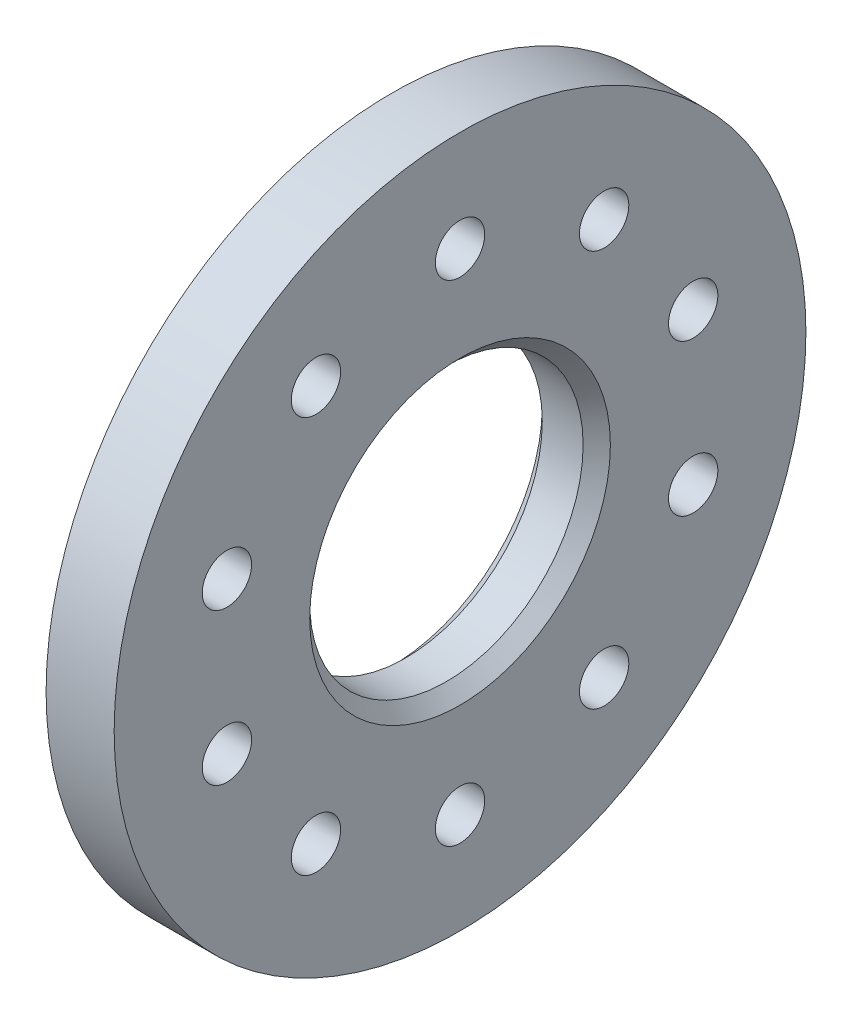
ISO-10303-21;
HEADER;
FILE_DESCRIPTION(('STEP AP214'),'2;1');
FILE_NAME('part.step','',(''),(''),'','','');
FILE_SCHEMA(('AUTOMOTIVE_DESIGN { 1 0 10303 214 1 1 1 1 }'));
ENDSEC;
DATA;
#1=APPLICATION_CONTEXT('core data for automotive mechanical design processes');
#2=APPLICATION_PROTOCOL_DEFINITION('international standard','automotive_design',2000,#1);
#3=PRODUCT_CONTEXT('',#1,'mechanical');
#4=PRODUCT('Part','Part','',(#3));
#5=PRODUCT_RELATED_PRODUCT_CATEGORY('part','',(#4));
#6=PRODUCT_DEFINITION_FORMATION('','',#4);
#7=PRODUCT_DEFINITION_CONTEXT('part definition',#1,'design');
#8=PRODUCT_DEFINITION('design','',#6,#7);
#9=PRODUCT_DEFINITION_SHAPE('','',#8);
#10=(LENGTH_UNIT() NAMED_UNIT(*) SI_UNIT(.MILLI.,.METRE.));
#11=(NAMED_UNIT(*) PLANE_ANGLE_UNIT() SI_UNIT($,.RADIAN.));
#12=(NAMED_UNIT(*) SI_UNIT($,.STERADIAN.) SOLID_ANGLE_UNIT());
#13=UNCERTAINTY_MEASURE_WITH_UNIT(LENGTH_MEASURE(1.E-05),#10,'distance_accuracy_value','');
#14=(GEOMETRIC_REPRESENTATION_CONTEXT(3) GLOBAL_UNCERTAINTY_ASSIGNED_CONTEXT((#13)) GLOBAL_UNIT_ASSIGNED_CONTEXT((#10,
#11,#12)) REPRESENTATION_CONTEXT('',''));
#15=CARTESIAN_POINT('',(0.,0.,0.));
#16=DIRECTION('',(0.,0.,1.));
#17=DIRECTION('',(1.,0.,0.));
#18=AXIS2_PLACEMENT_3D('',#15,#16,#17);
#19=CARTESIAN_POINT('',(7.9375,0.,0.));
#20=DIRECTION('',(-1.,0.,0.));
#21=DIRECTION('',(0.,0.,1.));
#22=AXIS2_PLACEMENT_3D('',#19,#20,#21);
#23=CYLINDRICAL_SURFACE('',#22,80.645);
#24=CARTESIAN_POINT('',(7.9375,0.,0.));
#25=DIRECTION('',(1.,0.,0.));
#26=DIRECTION('',(0.,0.,-1.));
#27=AXIS2_PLACEMENT_3D('',#24,#25,#26);
#28=CIRCLE('',#27,80.645);
#29=CARTESIAN_POINT('',(7.9375,0.,-80.645));
#30=VERTEX_POINT('',#29);
#31=EDGE_CURVE('E59',#30,#30,#28,.T.);
#32=ORIENTED_EDGE('',*,*,#31,.F.);
#33=EDGE_LOOP('',(#32));
#34=FACE_BOUND('',#33,.T.);
#35=CARTESIAN_POINT('',(-7.9375,0.,0.));
#36=DIRECTION('',(1.,0.,0.));
#37=DIRECTION('',(0.,0.,-1.));
#38=AXIS2_PLACEMENT_3D('',#35,#36,#37);
#39=CIRCLE('',#38,80.645);
#40=CARTESIAN_POINT('',(-7.9375,0.,-80.645));
#41=VERTEX_POINT('',#40);
#42=EDGE_CURVE('E60',#41,#41,#39,.T.);
#43=ORIENTED_EDGE('',*,*,#42,.T.);
#44=EDGE_LOOP('',(#43));
#45=FACE_BOUND('',#44,.T.);
#46=ADVANCED_FACE('F35',(#34,#45),#23,.T.);
#47=CARTESIAN_POINT('',(7.9375,0.,0.));
#48=DIRECTION('',(1.,0.,0.));
#49=DIRECTION('',(0.,0.,-1.));
#50=AXIS2_PLACEMENT_3D('',#47,#48,#49);
#51=PLANE('',#50);
#52=CARTESIAN_POINT('',(7.9375,-17.6603212285289,54.3528799062678));
#53=DIRECTION('',(1.,0.,0.));
#54=DIRECTION('',(0.,-0.95105651629515,-0.309016994374958));
#55=AXIS2_PLACEMENT_3D('',#52,#53,#54);
#56=CIRCLE('',#55,5.7546875);
#57=CARTESIAN_POINT('',(7.9375,-23.1333542746461,52.5745836714507));
#58=VERTEX_POINT('',#57);
#59=EDGE_CURVE('E120',#58,#58,#56,.T.);
#60=ORIENTED_EDGE('',*,*,#59,.F.);
#61=EDGE_LOOP('',(#60));
#62=FACE_BOUND('',#61,.T.);
#63=CARTESIAN_POINT('',(7.9375,46.235321228528,33.5919271685153));
#64=DIRECTION('',(1.,0.,0.));
#65=DIRECTION('',(0.,-0.58778525229248,0.809016994374942));
#66=AXIS2_PLACEMENT_3D('',#63,#64,#65);
#67=CIRCLE('',#66,5.7546875);
#68=CARTESIAN_POINT('',(7.9375,42.8528007844761,38.2475671533323));
#69=VERTEX_POINT('',#68);
#70=EDGE_CURVE('E114',#69,#69,#67,.T.);
#71=ORIENTED_EDGE('',*,*,#70,.F.);
#72=EDGE_LOOP('',(#71));
#73=FACE_BOUND('',#72,.T.);
#74=CARTESIAN_POINT('',(7.9375,46.2353212285285,-33.5919271685146));
#75=DIRECTION('',(1.,0.,0.));
#76=DIRECTION('',(0.,0.587785252292469,0.809016994374951));
#77=AXIS2_PLACEMENT_3D('',#74,#75,#76);
#78=CIRCLE('',#77,5.7546875);
#79=CARTESIAN_POINT('',(7.9375,49.6178416725803,-28.9362871836975));
#80=VERTEX_POINT('',#79);
#81=EDGE_CURVE('E108',#80,#80,#78,.T.);
#82=ORIENTED_EDGE('',*,*,#81,.F.);
#83=EDGE_LOOP('',(#82));
#84=FACE_BOUND('',#83,.T.);
#85=CARTESIAN_POINT('',(7.9375,-17.6603212285281,-54.3528799062681));
#86=DIRECTION('',(1.,0.,0.));
#87=DIRECTION('',(0.,0.951056516295155,-0.309016994374945));
#88=AXIS2_PLACEMENT_3D('',#85,#86,#87);
#89=CIRCLE('',#88,5.7546875);
#90=CARTESIAN_POINT('',(7.9375,-12.1872881824108,-56.1311761410852));
#91=VERTEX_POINT('',#90);
#92=EDGE_CURVE('E102',#91,#91,#89,.T.);
#93=ORIENTED_EDGE('',*,*,#92,.F.);
#94=EDGE_LOOP('',(#93));
#95=FACE_BOUND('',#94,.T.);
#96=CARTESIAN_POINT('',(7.9375,-57.15,0.));
#97=DIRECTION('',(1.,0.,0.));
#98=DIRECTION('',(0.,0.,-1.));
#99=AXIS2_PLACEMENT_3D('',#96,#97,#98);
#100=CIRCLE('',#99,5.7546875);
#101=CARTESIAN_POINT('',(7.9375,-57.15,-5.75468750000001));
#102=VERTEX_POINT('',#101);
#103=EDGE_CURVE('E96',#102,#102,#100,.T.);
#104=ORIENTED_EDGE('',*,*,#103,.F.);
#105=EDGE_LOOP('',(#104));
#106=FACE_BOUND('',#105,.T.);
#107=CARTESIAN_POINT('',(7.9375,17.6603212285289,-54.3528799062678));
#108=DIRECTION('',(1.,0.,0.));
#109=DIRECTION('',(0.,-0.95105651629515,-0.309016994374958));
#110=AXIS2_PLACEMENT_3D('',#107,#108,#109);
#111=CIRCLE('',#110,5.7546875);
#112=CARTESIAN_POINT('',(7.9375,12.1872881824116,-56.131176141085));
#113=VERTEX_POINT('',#112);
#114=EDGE_CURVE('E90',#113,#113,#111,.T.);
#115=ORIENTED_EDGE('',*,*,#114,.F.);
#116=EDGE_LOOP('',(#115));
#117=FACE_BOUND('',#116,.T.);
#118=CARTESIAN_POINT('',(7.9375,-46.235321228528,-33.5919271685152));
#119=DIRECTION('',(1.,0.,0.));
#120=DIRECTION('',(0.,-0.58778525229248,0.809016994374942));
#121=AXIS2_PLACEMENT_3D('',#118,#119,#120);
#122=CIRCLE('',#121,5.7546875);
#123=CARTESIAN_POINT('',(7.9375,-49.6178416725798,-28.9362871836982));
#124=VERTEX_POINT('',#123);
#125=EDGE_CURVE('E84',#124,#124,#122,.T.);
#126=ORIENTED_EDGE('',*,*,#125,.F.);
#127=EDGE_LOOP('',(#126));
#128=FACE_BOUND('',#127,.T.);
#129=CARTESIAN_POINT('',(7.9375,-46.2353212285284,33.5919271685146));
#130=DIRECTION('',(1.,0.,0.));
#131=DIRECTION('',(0.,0.587785252292469,0.809016994374951));
#132=AXIS2_PLACEMENT_3D('',#129,#130,#131);
#133=CIRCLE('',#132,5.7546875);
#134=CARTESIAN_POINT('',(7.9375,-42.8528007844766,38.2475671533317));
#135=VERTEX_POINT('',#134);
#136=EDGE_CURVE('E78',#135,#135,#133,.T.);
#137=ORIENTED_EDGE('',*,*,#136,.F.);
#138=EDGE_LOOP('',(#137));
#139=FACE_BOUND('',#138,.T.);
#140=CARTESIAN_POINT('',(7.9375,17.6603212285281,54.3528799062681));
#141=DIRECTION('',(1.,0.,0.));
#142=DIRECTION('',(0.,0.951056516295155,-0.309016994374945));
#143=AXIS2_PLACEMENT_3D('',#140,#141,#142);
#144=CIRCLE('',#143,5.7546875);
#145=CARTESIAN_POINT('',(7.9375,23.1333542746454,52.574583671451));
#146=VERTEX_POINT('',#145);
#147=EDGE_CURVE('E72',#146,#146,#144,.T.);
#148=ORIENTED_EDGE('',*,*,#147,.F.);
#149=EDGE_LOOP('',(#148));
#150=FACE_BOUND('',#149,.T.);
#151=CARTESIAN_POINT('',(7.9375,57.15,0.));
#152=DIRECTION('',(1.,0.,0.));
#153=DIRECTION('',(0.,0.,-1.));
#154=AXIS2_PLACEMENT_3D('',#151,#152,#153);
#155=CIRCLE('',#154,5.7546875);
#156=CARTESIAN_POINT('',(7.9375,57.15,-5.7546875));
#157=VERTEX_POINT('',#156);
#158=EDGE_CURVE('E66',#157,#157,#155,.T.);
#159=ORIENTED_EDGE('',*,*,#158,.F.);
#160=EDGE_LOOP('',(#159));
#161=FACE_BOUND('',#160,.T.);
#162=CARTESIAN_POINT('',(7.9375,0.,0.));
#163=DIRECTION('',(1.,0.,0.));
#164=DIRECTION('',(0.,0.,-1.));
#165=AXIS2_PLACEMENT_3D('',#162,#163,#164);
#166=CIRCLE('',#165,35.0520000000001);
#167=CARTESIAN_POINT('',(7.9375,0.,-35.0520000000001));
#168=VERTEX_POINT('',#167);
#169=EDGE_CURVE('E10',#168,#168,#166,.F.);
#170=ORIENTED_EDGE('',*,*,#169,.T.);
#171=EDGE_LOOP('',(#170));
#172=FACE_BOUND('',#171,.T.);
#173=ORIENTED_EDGE('',*,*,#31,.T.);
#174=EDGE_LOOP('',(#173));
#175=FACE_BOUND('',#174,.T.);
#176=ADVANCED_FACE('F136',(#62,#73,#84,#95,#106,#117,#128,#139,#150,#161,#172,#175),#51,.T.);
#177=CARTESIAN_POINT('',(-7.9375,0.,0.));
#178=DIRECTION('',(1.,0.,0.));
#179=DIRECTION('',(0.,0.,-1.));
#180=AXIS2_PLACEMENT_3D('',#177,#178,#179);
#181=PLANE('',#180);
#182=CARTESIAN_POINT('',(-7.9375,-17.6603212285289,54.3528799062678));
#183=DIRECTION('',(1.,0.,0.));
#184=DIRECTION('',(0.,-0.95105651629515,-0.309016994374958));
#185=AXIS2_PLACEMENT_3D('',#182,#183,#184);
#186=CIRCLE('',#185,5.7546875);
#187=CARTESIAN_POINT('',(-7.9375,-23.1333542746461,52.5745836714507));
#188=VERTEX_POINT('',#187);
#189=EDGE_CURVE('E117',#188,#188,#186,.T.);
#190=ORIENTED_EDGE('',*,*,#189,.T.);
#191=EDGE_LOOP('',(#190));
#192=FACE_BOUND('',#191,.T.);
#193=CARTESIAN_POINT('',(-7.9375,46.235321228528,33.5919271685153));
#194=DIRECTION('',(1.,0.,0.));
#195=DIRECTION('',(0.,-0.58778525229248,0.809016994374942));
#196=AXIS2_PLACEMENT_3D('',#193,#194,#195);
#197=CIRCLE('',#196,5.7546875);
#198=CARTESIAN_POINT('',(-7.9375,42.8528007844761,38.2475671533323));
#199=VERTEX_POINT('',#198);
#200=EDGE_CURVE('E111',#199,#199,#197,.T.);
#201=ORIENTED_EDGE('',*,*,#200,.T.);
#202=EDGE_LOOP('',(#201));
#203=FACE_BOUND('',#202,.T.);
#204=CARTESIAN_POINT('',(-7.9375,46.2353212285285,-33.5919271685146));
#205=DIRECTION('',(1.,0.,0.));
#206=DIRECTION('',(0.,0.587785252292469,0.809016994374951));
#207=AXIS2_PLACEMENT_3D('',#204,#205,#206);
#208=CIRCLE('',#207,5.7546875);
#209=CARTESIAN_POINT('',(-7.9375,49.6178416725803,-28.9362871836975));
#210=VERTEX_POINT('',#209);
#211=EDGE_CURVE('E105',#210,#210,#208,.T.);
#212=ORIENTED_EDGE('',*,*,#211,.T.);
#213=EDGE_LOOP('',(#212));
#214=FACE_BOUND('',#213,.T.);
#215=CARTESIAN_POINT('',(-7.9375,-17.6603212285281,-54.3528799062681));
#216=DIRECTION('',(1.,0.,0.));
#217=DIRECTION('',(0.,0.951056516295155,-0.309016994374945));
#218=AXIS2_PLACEMENT_3D('',#215,#216,#217);
#219=CIRCLE('',#218,5.7546875);
#220=CARTESIAN_POINT('',(-7.9375,-12.1872881824108,-56.1311761410852));
#221=VERTEX_POINT('',#220);
#222=EDGE_CURVE('E99',#221,#221,#219,.T.);
#223=ORIENTED_EDGE('',*,*,#222,.T.);
#224=EDGE_LOOP('',(#223));
#225=FACE_BOUND('',#224,.T.);
#226=CARTESIAN_POINT('',(-7.9375,-57.15,0.));
#227=DIRECTION('',(1.,0.,0.));
#228=DIRECTION('',(0.,0.,-1.));
#229=AXIS2_PLACEMENT_3D('',#226,#227,#228);
#230=CIRCLE('',#229,5.7546875);
#231=CARTESIAN_POINT('',(-7.9375,-57.15,-5.75468750000001));
#232=VERTEX_POINT('',#231);
#233=EDGE_CURVE('E93',#232,#232,#230,.T.);
#234=ORIENTED_EDGE('',*,*,#233,.T.);
#235=EDGE_LOOP('',(#234));
#236=FACE_BOUND('',#235,.T.);
#237=CARTESIAN_POINT('',(-7.9375,17.6603212285289,-54.3528799062678));
#238=DIRECTION('',(1.,0.,0.));
#239=DIRECTION('',(0.,-0.95105651629515,-0.309016994374958));
#240=AXIS2_PLACEMENT_3D('',#237,#238,#239);
#241=CIRCLE('',#240,5.7546875);
#242=CARTESIAN_POINT('',(-7.9375,12.1872881824116,-56.131176141085));
#243=VERTEX_POINT('',#242);
#244=EDGE_CURVE('E87',#243,#243,#241,.T.);
#245=ORIENTED_EDGE('',*,*,#244,.T.);
#246=EDGE_LOOP('',(#245));
#247=FACE_BOUND('',#246,.T.);
#248=CARTESIAN_POINT('',(-7.9375,-46.235321228528,-33.5919271685152));
#249=DIRECTION('',(1.,0.,0.));
#250=DIRECTION('',(0.,-0.58778525229248,0.809016994374942));
#251=AXIS2_PLACEMENT_3D('',#248,#249,#250);
#252=CIRCLE('',#251,5.7546875);
#253=CARTESIAN_POINT('',(-7.9375,-49.6178416725798,-28.9362871836982));
#254=VERTEX_POINT('',#253);
#255=EDGE_CURVE('E81',#254,#254,#252,.T.);
#256=ORIENTED_EDGE('',*,*,#255,.T.);
#257=EDGE_LOOP('',(#256));
#258=FACE_BOUND('',#257,.T.);
#259=CARTESIAN_POINT('',(-7.9375,-46.2353212285284,33.5919271685146));
#260=DIRECTION('',(1.,0.,0.));
#261=DIRECTION('',(0.,0.587785252292469,0.809016994374951));
#262=AXIS2_PLACEMENT_3D('',#259,#260,#261);
#263=CIRCLE('',#262,5.7546875);
#264=CARTESIAN_POINT('',(-7.9375,-42.8528007844766,38.2475671533317));
#265=VERTEX_POINT('',#264);
#266=EDGE_CURVE('E75',#265,#265,#263,.T.);
#267=ORIENTED_EDGE('',*,*,#266,.T.);
#268=EDGE_LOOP('',(#267));
#269=FACE_BOUND('',#268,.T.);
#270=CARTESIAN_POINT('',(-7.9375,17.6603212285281,54.3528799062681));
#271=DIRECTION('',(1.,0.,0.));
#272=DIRECTION('',(0.,0.951056516295155,-0.309016994374945));
#273=AXIS2_PLACEMENT_3D('',#270,#271,#272);
#274=CIRCLE('',#273,5.7546875);
#275=CARTESIAN_POINT('',(-7.9375,23.1333542746454,52.574583671451));
#276=VERTEX_POINT('',#275);
#277=EDGE_CURVE('E69',#276,#276,#274,.T.);
#278=ORIENTED_EDGE('',*,*,#277,.T.);
#279=EDGE_LOOP('',(#278));
#280=FACE_BOUND('',#279,.T.);
#281=CARTESIAN_POINT('',(-7.9375,57.15,0.));
#282=DIRECTION('',(1.,0.,0.));
#283=DIRECTION('',(0.,0.,-1.));
#284=AXIS2_PLACEMENT_3D('',#281,#282,#283);
#285=CIRCLE('',#284,5.7546875);
#286=CARTESIAN_POINT('',(-7.9375,57.15,-5.7546875));
#287=VERTEX_POINT('',#286);
#288=EDGE_CURVE('E63',#287,#287,#285,.T.);
#289=ORIENTED_EDGE('',*,*,#288,.T.);
#290=EDGE_LOOP('',(#289));
#291=FACE_BOUND('',#290,.T.);
#292=CARTESIAN_POINT('',(-7.9375,0.,0.));
#293=DIRECTION('',(1.,0.,0.));
#294=DIRECTION('',(0.,0.,-1.));
#295=AXIS2_PLACEMENT_3D('',#292,#293,#294);
#296=CIRCLE('',#295,35.052);
#297=CARTESIAN_POINT('',(-7.9375,0.,-35.052));
#298=VERTEX_POINT('',#297);
#299=EDGE_CURVE('E54',#298,#298,#296,.T.);
#300=ORIENTED_EDGE('',*,*,#299,.T.);
#301=EDGE_LOOP('',(#300));
#302=FACE_BOUND('',#301,.T.);
#303=ORIENTED_EDGE('',*,*,#42,.F.);
#304=EDGE_LOOP('',(#303));
#305=FACE_BOUND('',#304,.T.);
#306=ADVANCED_FACE('F126',(#192,#203,#214,#225,#236,#247,#258,#269,#280,#291,#302,#305),#181,.F.);
#307=CARTESIAN_POINT('',(-7.9375,0.,0.));
#308=DIRECTION('',(1.,0.,0.));
#309=DIRECTION('',(0.,0.,-1.));
#310=AXIS2_PLACEMENT_3D('',#307,#308,#309);
#311=CYLINDRICAL_SURFACE('',#310,31.877);
#312=CARTESIAN_POINT('',(-4.76249999999998,0.,0.));
#313=DIRECTION('',(1.,0.,0.));
#314=DIRECTION('',(0.,0.,-1.));
#315=AXIS2_PLACEMENT_3D('',#312,#313,#314);
#316=CIRCLE('',#315,31.877);
#317=CARTESIAN_POINT('',(-4.76249999999998,0.,-31.877));
#318=VERTEX_POINT('',#317);
#319=EDGE_CURVE('E43',#318,#318,#316,.F.);
#320=ORIENTED_EDGE('',*,*,#319,.T.);
#321=EDGE_LOOP('',(#320));
#322=FACE_BOUND('',#321,.T.);
#323=CARTESIAN_POINT('',(4.76249999999995,0.,0.));
#324=DIRECTION('',(1.,0.,0.));
#325=DIRECTION('',(0.,0.,-1.));
#326=AXIS2_PLACEMENT_3D('',#323,#324,#325);
#327=CIRCLE('',#326,31.877);
#328=CARTESIAN_POINT('',(4.76249999999995,0.,-31.877));
#329=VERTEX_POINT('',#328);
#330=EDGE_CURVE('E49',#329,#329,#327,.T.);
#331=ORIENTED_EDGE('',*,*,#330,.T.);
#332=EDGE_LOOP('',(#331));
#333=FACE_BOUND('',#332,.T.);
#334=ADVANCED_FACE('F166',(#322,#333),#311,.F.);
#335=CARTESIAN_POINT('',(-7.9375,0.,0.));
#336=DIRECTION('',(-1.,0.,0.));
#337=DIRECTION('',(0.,0.,1.));
#338=AXIS2_PLACEMENT_3D('',#335,#336,#337);
#339=CONICAL_SURFACE('',#338,35.052,0.785398163397445);
#340=ORIENTED_EDGE('',*,*,#319,.F.);
#341=EDGE_LOOP('',(#340));
#342=FACE_BOUND('',#341,.T.);
#343=ORIENTED_EDGE('',*,*,#299,.F.);
#344=EDGE_LOOP('',(#343));
#345=FACE_BOUND('',#344,.T.);
#346=ADVANCED_FACE('F171',(#342,#345),#339,.F.);
#347=CARTESIAN_POINT('',(4.76249999999995,0.,0.));
#348=DIRECTION('',(1.,0.,0.));
#349=DIRECTION('',(0.,0.,-1.));
#350=AXIS2_PLACEMENT_3D('',#347,#348,#349);
#351=CONICAL_SURFACE('',#350,31.877,0.785398163397449);
#352=ORIENTED_EDGE('',*,*,#169,.F.);
#353=EDGE_LOOP('',(#352));
#354=FACE_BOUND('',#353,.T.);
#355=ORIENTED_EDGE('',*,*,#330,.F.);
#356=EDGE_LOOP('',(#355));
#357=FACE_BOUND('',#356,.T.);
#358=ADVANCED_FACE('F37',(#354,#357),#351,.F.);
#359=CARTESIAN_POINT('',(-7.9375,57.15,0.));
#360=DIRECTION('',(1.,0.,0.));
#361=DIRECTION('',(0.,0.,-1.));
#362=AXIS2_PLACEMENT_3D('',#359,#360,#361);
#363=CYLINDRICAL_SURFACE('',#362,5.7546875);
#364=ORIENTED_EDGE('',*,*,#288,.F.);
#365=EDGE_LOOP('',(#364));
#366=FACE_BOUND('',#365,.T.);
#367=ORIENTED_EDGE('',*,*,#158,.T.);
#368=EDGE_LOOP('',(#367));
#369=FACE_BOUND('',#368,.T.);
#370=ADVANCED_FACE('F178',(#366,#369),#363,.F.);
#371=CARTESIAN_POINT('',(-7.9375,17.6603212285281,54.3528799062681));
#372=DIRECTION('',(1.,0.,0.));
#373=DIRECTION('',(0.,0.,-1.));
#374=AXIS2_PLACEMENT_3D('',#371,#372,#373);
#375=CYLINDRICAL_SURFACE('',#374,5.7546875);
#376=ORIENTED_EDGE('',*,*,#277,.F.);
#377=EDGE_LOOP('',(#376));
#378=FACE_BOUND('',#377,.T.);
#379=ORIENTED_EDGE('',*,*,#147,.T.);
#380=EDGE_LOOP('',(#379));
#381=FACE_BOUND('',#380,.T.);
#382=ADVANCED_FACE('F186',(#378,#381),#375,.F.);
#383=CARTESIAN_POINT('',(-7.9375,-46.2353212285284,33.5919271685146));
#384=DIRECTION('',(1.,0.,0.));
#385=DIRECTION('',(0.,0.,-1.));
#386=AXIS2_PLACEMENT_3D('',#383,#384,#385);
#387=CYLINDRICAL_SURFACE('',#386,5.7546875);
#388=ORIENTED_EDGE('',*,*,#266,.F.);
#389=EDGE_LOOP('',(#388));
#390=FACE_BOUND('',#389,.T.);
#391=ORIENTED_EDGE('',*,*,#136,.T.);
#392=EDGE_LOOP('',(#391));
#393=FACE_BOUND('',#392,.T.);
#394=ADVANCED_FACE('F195',(#390,#393),#387,.F.);
#395=CARTESIAN_POINT('',(-7.9375,-46.235321228528,-33.5919271685152));
#396=DIRECTION('',(1.,0.,0.));
#397=DIRECTION('',(0.,0.,-1.));
#398=AXIS2_PLACEMENT_3D('',#395,#396,#397);
#399=CYLINDRICAL_SURFACE('',#398,5.7546875);
#400=ORIENTED_EDGE('',*,*,#255,.F.);
#401=EDGE_LOOP('',(#400));
#402=FACE_BOUND('',#401,.T.);
#403=ORIENTED_EDGE('',*,*,#125,.T.);
#404=EDGE_LOOP('',(#403));
#405=FACE_BOUND('',#404,.T.);
#406=ADVANCED_FACE('F203',(#402,#405),#399,.F.);
#407=CARTESIAN_POINT('',(-7.9375,17.6603212285289,-54.3528799062678));
#408=DIRECTION('',(1.,0.,0.));
#409=DIRECTION('',(0.,0.,-1.));
#410=AXIS2_PLACEMENT_3D('',#407,#408,#409);
#411=CYLINDRICAL_SURFACE('',#410,5.7546875);
#412=ORIENTED_EDGE('',*,*,#244,.F.);
#413=EDGE_LOOP('',(#412));
#414=FACE_BOUND('',#413,.T.);
#415=ORIENTED_EDGE('',*,*,#114,.T.);
#416=EDGE_LOOP('',(#415));
#417=FACE_BOUND('',#416,.T.);
#418=ADVANCED_FACE('F207',(#414,#417),#411,.F.);
#419=CARTESIAN_POINT('',(-7.9375,-57.15,0.));
#420=DIRECTION('',(1.,0.,0.));
#421=DIRECTION('',(0.,0.,-1.));
#422=AXIS2_PLACEMENT_3D('',#419,#420,#421);
#423=CYLINDRICAL_SURFACE('',#422,5.7546875);
#424=ORIENTED_EDGE('',*,*,#233,.F.);
#425=EDGE_LOOP('',(#424));
#426=FACE_BOUND('',#425,.T.);
#427=ORIENTED_EDGE('',*,*,#103,.T.);
#428=EDGE_LOOP('',(#427));
#429=FACE_BOUND('',#428,.T.);
#430=ADVANCED_FACE('F211',(#426,#429),#423,.F.);
#431=CARTESIAN_POINT('',(-7.9375,-17.6603212285281,-54.3528799062681));
#432=DIRECTION('',(1.,0.,0.));
#433=DIRECTION('',(0.,0.,-1.));
#434=AXIS2_PLACEMENT_3D('',#431,#432,#433);
#435=CYLINDRICAL_SURFACE('',#434,5.7546875);
#436=ORIENTED_EDGE('',*,*,#222,.F.);
#437=EDGE_LOOP('',(#436));
#438=FACE_BOUND('',#437,.T.);
#439=ORIENTED_EDGE('',*,*,#92,.T.);
#440=EDGE_LOOP('',(#439));
#441=FACE_BOUND('',#440,.T.);
#442=ADVANCED_FACE('F215',(#438,#441),#435,.F.);
#443=CARTESIAN_POINT('',(-7.9375,46.2353212285285,-33.5919271685146));
#444=DIRECTION('',(1.,0.,0.));
#445=DIRECTION('',(0.,0.,-1.));
#446=AXIS2_PLACEMENT_3D('',#443,#444,#445);
#447=CYLINDRICAL_SURFACE('',#446,5.7546875);
#448=ORIENTED_EDGE('',*,*,#211,.F.);
#449=EDGE_LOOP('',(#448));
#450=FACE_BOUND('',#449,.T.);
#451=ORIENTED_EDGE('',*,*,#81,.T.);
#452=EDGE_LOOP('',(#451));
#453=FACE_BOUND('',#452,.T.);
#454=ADVANCED_FACE('F219',(#450,#453),#447,.F.);
#455=CARTESIAN_POINT('',(-7.9375,46.235321228528,33.5919271685153));
#456=DIRECTION('',(1.,0.,0.));
#457=DIRECTION('',(0.,0.,-1.));
#458=AXIS2_PLACEMENT_3D('',#455,#456,#457);
#459=CYLINDRICAL_SURFACE('',#458,5.7546875);
#460=ORIENTED_EDGE('',*,*,#200,.F.);
#461=EDGE_LOOP('',(#460));
#462=FACE_BOUND('',#461,.T.);
#463=ORIENTED_EDGE('',*,*,#70,.T.);
#464=EDGE_LOOP('',(#463));
#465=FACE_BOUND('',#464,.T.);
#466=ADVANCED_FACE('F132',(#462,#465),#459,.F.);
#467=CARTESIAN_POINT('',(-7.9375,-17.6603212285289,54.3528799062678));
#468=DIRECTION('',(1.,0.,0.));
#469=DIRECTION('',(0.,0.,-1.));
#470=AXIS2_PLACEMENT_3D('',#467,#468,#469);
#471=CYLINDRICAL_SURFACE('',#470,5.7546875);
#472=ORIENTED_EDGE('',*,*,#189,.F.);
#473=EDGE_LOOP('',(#472));
#474=FACE_BOUND('',#473,.T.);
#475=ORIENTED_EDGE('',*,*,#59,.T.);
#476=EDGE_LOOP('',(#475));
#477=FACE_BOUND('',#476,.T.);
#478=ADVANCED_FACE('F129',(#474,#477),#471,.F.);
#479=CLOSED_SHELL('',(#46,#176,#306,#334,#346,#358,#370,#382,#394,#406,#418,#430,#442,#454,#466,#478));
#480=MANIFOLD_SOLID_BREP('B2',#479);
#481=ADVANCED_BREP_SHAPE_REPRESENTATION('',(#18,#480),#14);
#482=SHAPE_DEFINITION_REPRESENTATION(#9,#481);
ENDSEC;
END-ISO-10303-21;
